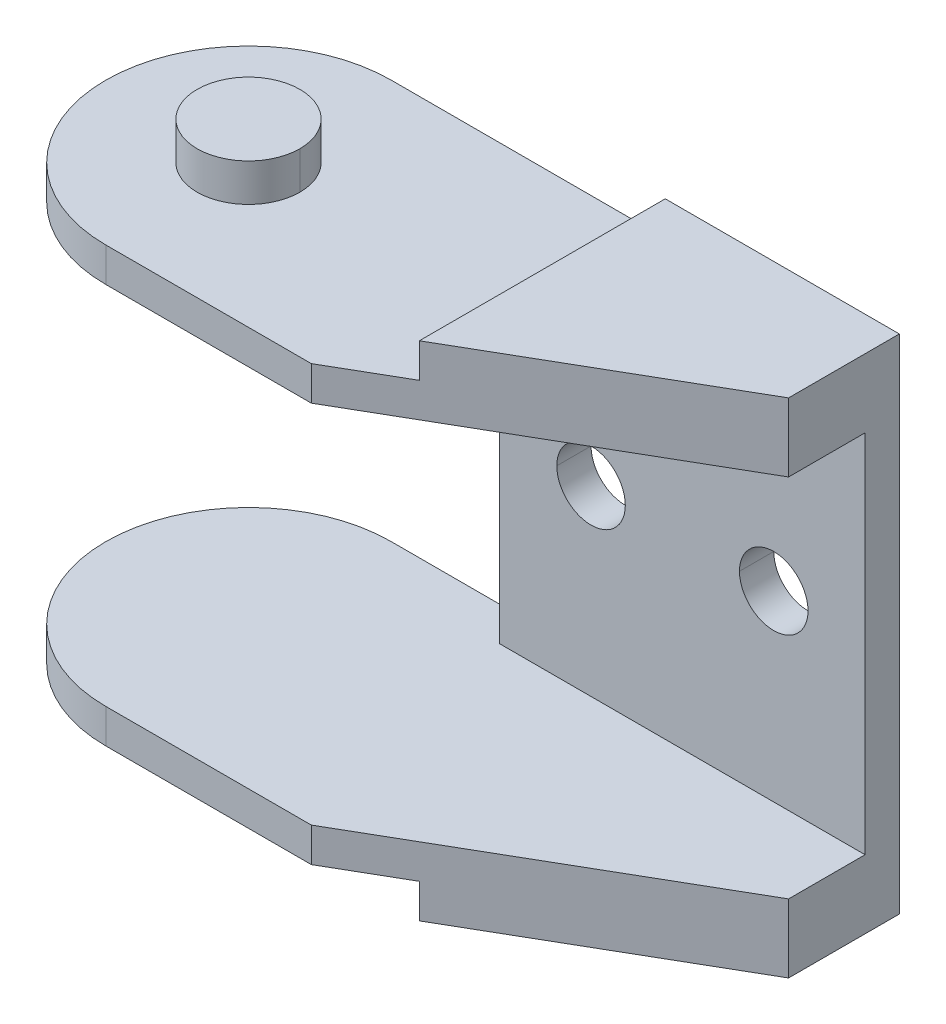
ISO-10303-21;
HEADER;
FILE_DESCRIPTION(('STEP AP214'),'2;1');
FILE_NAME('part.step','',(''),(''),'','','');
FILE_SCHEMA(('AUTOMOTIVE_DESIGN { 1 0 10303 214 1 1 1 1 }'));
ENDSEC;
DATA;
#1=APPLICATION_CONTEXT('core data for automotive mechanical design processes');
#2=APPLICATION_PROTOCOL_DEFINITION('international standard','automotive_design',2000,#1);
#3=PRODUCT_CONTEXT('',#1,'mechanical');
#4=PRODUCT('Part','Part','',(#3));
#5=PRODUCT_RELATED_PRODUCT_CATEGORY('part','',(#4));
#6=PRODUCT_DEFINITION_FORMATION('','',#4);
#7=PRODUCT_DEFINITION_CONTEXT('part definition',#1,'design');
#8=PRODUCT_DEFINITION('design','',#6,#7);
#9=PRODUCT_DEFINITION_SHAPE('','',#8);
#10=(LENGTH_UNIT() NAMED_UNIT(*) SI_UNIT(.MILLI.,.METRE.));
#11=(NAMED_UNIT(*) PLANE_ANGLE_UNIT() SI_UNIT($,.RADIAN.));
#12=(NAMED_UNIT(*) SI_UNIT($,.STERADIAN.) SOLID_ANGLE_UNIT());
#13=UNCERTAINTY_MEASURE_WITH_UNIT(LENGTH_MEASURE(1.E-05),#10,'distance_accuracy_value','');
#14=(GEOMETRIC_REPRESENTATION_CONTEXT(3) GLOBAL_UNCERTAINTY_ASSIGNED_CONTEXT((#13)) GLOBAL_UNIT_ASSIGNED_CONTEXT((#10,
#11,#12)) REPRESENTATION_CONTEXT('',''));
#15=CARTESIAN_POINT('',(0.,0.,0.));
#16=DIRECTION('',(0.,0.,1.));
#17=DIRECTION('',(1.,0.,0.));
#18=AXIS2_PLACEMENT_3D('',#15,#16,#17);
#19=CARTESIAN_POINT('',(0.,-10.325,0.));
#20=DIRECTION('',(0.,-1.,0.));
#21=DIRECTION('',(1.,0.,0.));
#22=AXIS2_PLACEMENT_3D('',#19,#20,#21);
#23=CYLINDRICAL_SURFACE('',#22,2.25);
#24=DIRECTION('',(0.,-1.,0.));
#25=VECTOR('',#24,1.);
#26=CARTESIAN_POINT('',(2.25,-10.325,0.));
#27=LINE('',#26,#25);
#28=CARTESIAN_POINT('',(2.25,-9.5,0.));
#29=VERTEX_POINT('',#28);
#30=CARTESIAN_POINT('',(2.25,-11.15,0.));
#31=VERTEX_POINT('',#30);
#32=EDGE_CURVE('E341',#29,#31,#27,.T.);
#33=ORIENTED_EDGE('',*,*,#32,.F.);
#34=CARTESIAN_POINT('',(0.,-9.5,0.));
#35=DIRECTION('',(0.,1.,0.));
#36=DIRECTION('',(1.,0.,0.));
#37=AXIS2_PLACEMENT_3D('',#34,#35,#36);
#38=CIRCLE('',#37,2.25);
#39=CARTESIAN_POINT('',(-2.25,-9.5,0.));
#40=VERTEX_POINT('',#39);
#41=EDGE_CURVE('E41',#40,#29,#38,.T.);
#42=ORIENTED_EDGE('',*,*,#41,.F.);
#43=DIRECTION('',(0.,1.,0.));
#44=VECTOR('',#43,1.);
#45=CARTESIAN_POINT('',(-2.25,-10.325,0.));
#46=LINE('',#45,#44);
#47=CARTESIAN_POINT('',(-2.25,-11.15,0.));
#48=VERTEX_POINT('',#47);
#49=EDGE_CURVE('E337',#48,#40,#46,.T.);
#50=ORIENTED_EDGE('',*,*,#49,.F.);
#51=CARTESIAN_POINT('',(0.,-11.15,0.));
#52=DIRECTION('',(0.,-1.,0.));
#53=DIRECTION('',(1.,0.,0.));
#54=AXIS2_PLACEMENT_3D('',#51,#52,#53);
#55=CIRCLE('',#54,2.25);
#56=EDGE_CURVE('E342',#31,#48,#55,.T.);
#57=ORIENTED_EDGE('',*,*,#56,.F.);
#58=EDGE_LOOP('',(#33,#42,#50,#57));
#59=FACE_BOUND('',#58,.T.);
#60=ADVANCED_FACE('F17',(#59),#23,.T.);
#61=CARTESIAN_POINT('',(0.,10.325,0.));
#62=DIRECTION('',(0.,-1.,0.));
#63=DIRECTION('',(1.,0.,0.));
#64=AXIS2_PLACEMENT_3D('',#61,#62,#63);
#65=CYLINDRICAL_SURFACE('',#64,2.25);
#66=DIRECTION('',(0.,-1.,0.));
#67=VECTOR('',#66,1.);
#68=CARTESIAN_POINT('',(2.25,10.325,0.));
#69=LINE('',#68,#67);
#70=CARTESIAN_POINT('',(2.25,11.15,0.));
#71=VERTEX_POINT('',#70);
#72=CARTESIAN_POINT('',(2.25,9.5,0.));
#73=VERTEX_POINT('',#72);
#74=EDGE_CURVE('E381',#71,#73,#69,.T.);
#75=ORIENTED_EDGE('',*,*,#74,.F.);
#76=CARTESIAN_POINT('',(0.,11.15,0.));
#77=DIRECTION('',(0.,1.,0.));
#78=DIRECTION('',(1.,0.,0.));
#79=AXIS2_PLACEMENT_3D('',#76,#77,#78);
#80=CIRCLE('',#79,2.25);
#81=CARTESIAN_POINT('',(-2.25,11.15,0.));
#82=VERTEX_POINT('',#81);
#83=EDGE_CURVE('E248',#82,#71,#80,.T.);
#84=ORIENTED_EDGE('',*,*,#83,.F.);
#85=DIRECTION('',(0.,1.,0.));
#86=VECTOR('',#85,1.);
#87=CARTESIAN_POINT('',(-2.25,10.325,0.));
#88=LINE('',#87,#86);
#89=CARTESIAN_POINT('',(-2.25,9.5,0.));
#90=VERTEX_POINT('',#89);
#91=EDGE_CURVE('E377',#90,#82,#88,.T.);
#92=ORIENTED_EDGE('',*,*,#91,.F.);
#93=CARTESIAN_POINT('',(0.,9.5,0.));
#94=DIRECTION('',(0.,-1.,0.));
#95=DIRECTION('',(1.,0.,0.));
#96=AXIS2_PLACEMENT_3D('',#93,#94,#95);
#97=CIRCLE('',#96,2.25);
#98=EDGE_CURVE('E249',#73,#90,#97,.T.);
#99=ORIENTED_EDGE('',*,*,#98,.F.);
#100=EDGE_LOOP('',(#75,#84,#92,#99));
#101=FACE_BOUND('',#100,.T.);
#102=ADVANCED_FACE('F460',(#101),#65,.T.);
#103=CARTESIAN_POINT('',(18.25,0.,-5.5));
#104=DIRECTION('',(0.,0.,1.));
#105=DIRECTION('',(1.,0.,0.));
#106=AXIS2_PLACEMENT_3D('',#103,#104,#105);
#107=CYLINDRICAL_SURFACE('',#106,1.5);
#108=DIRECTION('',(0.,0.,-1.));
#109=VECTOR('',#108,1.);
#110=CARTESIAN_POINT('',(19.75,0.,-5.5));
#111=LINE('',#110,#109);
#112=CARTESIAN_POINT('',(19.75,0.,-4.75));
#113=VERTEX_POINT('',#112);
#114=CARTESIAN_POINT('',(19.75,0.,-6.25));
#115=VERTEX_POINT('',#114);
#116=EDGE_CURVE('E269',#113,#115,#111,.T.);
#117=ORIENTED_EDGE('',*,*,#116,.F.);
#118=CARTESIAN_POINT('',(18.25,0.,-4.75));
#119=DIRECTION('',(0.,0.,-1.));
#120=DIRECTION('',(1.,0.,0.));
#121=AXIS2_PLACEMENT_3D('',#118,#119,#120);
#122=CIRCLE('',#121,1.5);
#123=CARTESIAN_POINT('',(16.75,0.,-4.75));
#124=VERTEX_POINT('',#123);
#125=EDGE_CURVE('E329',#124,#113,#122,.T.);
#126=ORIENTED_EDGE('',*,*,#125,.F.);
#127=DIRECTION('',(0.,0.,1.));
#128=VECTOR('',#127,1.);
#129=CARTESIAN_POINT('',(16.75,0.,-5.5));
#130=LINE('',#129,#128);
#131=CARTESIAN_POINT('',(16.75,0.,-6.25));
#132=VERTEX_POINT('',#131);
#133=EDGE_CURVE('E274',#132,#124,#130,.T.);
#134=ORIENTED_EDGE('',*,*,#133,.F.);
#135=CARTESIAN_POINT('',(18.25,0.,-6.25));
#136=DIRECTION('',(0.,0.,1.));
#137=DIRECTION('',(1.,0.,0.));
#138=AXIS2_PLACEMENT_3D('',#135,#136,#137);
#139=CIRCLE('',#138,1.5);
#140=EDGE_CURVE('E227',#115,#132,#139,.T.);
#141=ORIENTED_EDGE('',*,*,#140,.F.);
#142=EDGE_LOOP('',(#117,#126,#134,#141));
#143=FACE_BOUND('',#142,.T.);
#144=ADVANCED_FACE('F466',(#143),#107,.F.);
#145=CARTESIAN_POINT('',(10.25,0.,-5.5));
#146=DIRECTION('',(0.,0.,1.));
#147=DIRECTION('',(1.,0.,0.));
#148=AXIS2_PLACEMENT_3D('',#145,#146,#147);
#149=CYLINDRICAL_SURFACE('',#148,1.5);
#150=DIRECTION('',(0.,0.,-1.));
#151=VECTOR('',#150,1.);
#152=CARTESIAN_POINT('',(11.75,0.,-5.5));
#153=LINE('',#152,#151);
#154=CARTESIAN_POINT('',(11.75,0.,-4.75));
#155=VERTEX_POINT('',#154);
#156=CARTESIAN_POINT('',(11.75,0.,-6.25));
#157=VERTEX_POINT('',#156);
#158=EDGE_CURVE('E21',#155,#157,#153,.T.);
#159=ORIENTED_EDGE('',*,*,#158,.F.);
#160=CARTESIAN_POINT('',(10.25,0.,-4.75));
#161=DIRECTION('',(0.,0.,-1.));
#162=DIRECTION('',(1.,0.,0.));
#163=AXIS2_PLACEMENT_3D('',#160,#161,#162);
#164=CIRCLE('',#163,1.5);
#165=CARTESIAN_POINT('',(8.75,0.,-4.75));
#166=VERTEX_POINT('',#165);
#167=EDGE_CURVE('E343',#166,#155,#164,.T.);
#168=ORIENTED_EDGE('',*,*,#167,.F.);
#169=DIRECTION('',(0.,0.,1.));
#170=VECTOR('',#169,1.);
#171=CARTESIAN_POINT('',(8.75,0.,-5.5));
#172=LINE('',#171,#170);
#173=CARTESIAN_POINT('',(8.75,0.,-6.25));
#174=VERTEX_POINT('',#173);
#175=EDGE_CURVE('E273',#174,#166,#172,.T.);
#176=ORIENTED_EDGE('',*,*,#175,.F.);
#177=CARTESIAN_POINT('',(10.25,0.,-6.25));
#178=DIRECTION('',(0.,0.,1.));
#179=DIRECTION('',(1.,0.,0.));
#180=AXIS2_PLACEMENT_3D('',#177,#178,#179);
#181=CIRCLE('',#180,1.5);
#182=EDGE_CURVE('E358',#157,#174,#181,.T.);
#183=ORIENTED_EDGE('',*,*,#182,.F.);
#184=EDGE_LOOP('',(#159,#168,#176,#183));
#185=FACE_BOUND('',#184,.T.);
#186=ADVANCED_FACE('F431',(#185),#149,.F.);
#187=CARTESIAN_POINT('',(14.25,-9.5,-4.75));
#188=DIRECTION('',(0.,0.,1.));
#189=DIRECTION('',(1.,0.,0.));
#190=AXIS2_PLACEMENT_3D('',#187,#188,#189);
#191=PLANE('',#190);
#192=DIRECTION('',(-1.,0.,0.));
#193=VECTOR('',#192,1.);
#194=CARTESIAN_POINT('',(8.5625,-8.,-4.75));
#195=LINE('',#194,#193);
#196=CARTESIAN_POINT('',(22.25,-8.,-4.75));
#197=VERTEX_POINT('',#196);
#198=CARTESIAN_POINT('',(6.25,-8.,-4.75));
#199=VERTEX_POINT('',#198);
#200=EDGE_CURVE('E315',#197,#199,#195,.T.);
#201=ORIENTED_EDGE('',*,*,#200,.F.);
#202=DIRECTION('',(0.,1.,0.));
#203=VECTOR('',#202,1.);
#204=CARTESIAN_POINT('',(22.25,-9.5,-4.75));
#205=LINE('',#204,#203);
#206=CARTESIAN_POINT('',(22.25,8.,-4.75));
#207=VERTEX_POINT('',#206);
#208=EDGE_CURVE('E11',#197,#207,#205,.T.);
#209=ORIENTED_EDGE('',*,*,#208,.T.);
#210=DIRECTION('',(1.,0.,0.));
#211=VECTOR('',#210,1.);
#212=CARTESIAN_POINT('',(8.5625,8.,-4.75));
#213=LINE('',#212,#211);
#214=CARTESIAN_POINT('',(6.25,8.,-4.75));
#215=VERTEX_POINT('',#214);
#216=EDGE_CURVE('E352',#215,#207,#213,.T.);
#217=ORIENTED_EDGE('',*,*,#216,.F.);
#218=DIRECTION('',(0.,1.,0.));
#219=VECTOR('',#218,1.);
#220=CARTESIAN_POINT('',(6.25,-9.5,-4.75));
#221=LINE('',#220,#219);
#222=EDGE_CURVE('E386',#199,#215,#221,.T.);
#223=ORIENTED_EDGE('',*,*,#222,.F.);
#224=EDGE_LOOP('',(#201,#209,#217,#223));
#225=FACE_BOUND('',#224,.T.);
#226=CARTESIAN_POINT('',(18.25,0.,-4.75));
#227=DIRECTION('',(0.,0.,-1.));
#228=DIRECTION('',(1.,0.,0.));
#229=AXIS2_PLACEMENT_3D('',#226,#227,#228);
#230=CIRCLE('',#229,1.5);
#231=EDGE_CURVE('E28',#113,#124,#230,.T.);
#232=ORIENTED_EDGE('',*,*,#231,.T.);
#233=ORIENTED_EDGE('',*,*,#125,.T.);
#234=EDGE_LOOP('',(#232,#233));
#235=FACE_BOUND('',#234,.T.);
#236=CARTESIAN_POINT('',(10.25,0.,-4.75));
#237=DIRECTION('',(0.,0.,-1.));
#238=DIRECTION('',(1.,0.,0.));
#239=AXIS2_PLACEMENT_3D('',#236,#237,#238);
#240=CIRCLE('',#239,1.5);
#241=EDGE_CURVE('E347',#155,#166,#240,.T.);
#242=ORIENTED_EDGE('',*,*,#241,.T.);
#243=ORIENTED_EDGE('',*,*,#167,.T.);
#244=EDGE_LOOP('',(#242,#243));
#245=FACE_BOUND('',#244,.T.);
#246=ADVANCED_FACE('F438',(#225,#235,#245),#191,.T.);
#247=CARTESIAN_POINT('',(10.25,0.,-5.5));
#248=DIRECTION('',(0.,0.,1.));
#249=DIRECTION('',(1.,0.,0.));
#250=AXIS2_PLACEMENT_3D('',#247,#248,#249);
#251=CYLINDRICAL_SURFACE('',#250,1.5);
#252=ORIENTED_EDGE('',*,*,#158,.T.);
#253=CARTESIAN_POINT('',(10.25,0.,-6.25));
#254=DIRECTION('',(0.,0.,1.));
#255=DIRECTION('',(1.,0.,0.));
#256=AXIS2_PLACEMENT_3D('',#253,#254,#255);
#257=CIRCLE('',#256,1.5);
#258=EDGE_CURVE('E319',#174,#157,#257,.T.);
#259=ORIENTED_EDGE('',*,*,#258,.F.);
#260=ORIENTED_EDGE('',*,*,#175,.T.);
#261=ORIENTED_EDGE('',*,*,#241,.F.);
#262=EDGE_LOOP('',(#252,#259,#260,#261));
#263=FACE_BOUND('',#262,.T.);
#264=ADVANCED_FACE('F439',(#263),#251,.F.);
#265=CARTESIAN_POINT('',(18.25,0.,-5.5));
#266=DIRECTION('',(0.,0.,1.));
#267=DIRECTION('',(1.,0.,0.));
#268=AXIS2_PLACEMENT_3D('',#265,#266,#267);
#269=CYLINDRICAL_SURFACE('',#268,1.5);
#270=ORIENTED_EDGE('',*,*,#116,.T.);
#271=CARTESIAN_POINT('',(18.25,0.,-6.25));
#272=DIRECTION('',(0.,0.,1.));
#273=DIRECTION('',(1.,0.,0.));
#274=AXIS2_PLACEMENT_3D('',#271,#272,#273);
#275=CIRCLE('',#274,1.5);
#276=EDGE_CURVE('E362',#132,#115,#275,.T.);
#277=ORIENTED_EDGE('',*,*,#276,.F.);
#278=ORIENTED_EDGE('',*,*,#133,.T.);
#279=ORIENTED_EDGE('',*,*,#231,.F.);
#280=EDGE_LOOP('',(#270,#277,#278,#279));
#281=FACE_BOUND('',#280,.T.);
#282=ADVANCED_FACE('F406',(#281),#269,.F.);
#283=CARTESIAN_POINT('',(6.25,-9.5,-5.5));
#284=DIRECTION('',(-1.,0.,0.));
#285=DIRECTION('',(0.,0.,1.));
#286=AXIS2_PLACEMENT_3D('',#283,#284,#285);
#287=PLANE('',#286);
#288=DIRECTION('',(0.,0.,-1.));
#289=VECTOR('',#288,1.);
#290=CARTESIAN_POINT('',(6.25,-8.,-2.75));
#291=LINE('',#290,#289);
#292=CARTESIAN_POINT('',(6.25,-8.,-6.25));
#293=VERTEX_POINT('',#292);
#294=EDGE_CURVE('E320',#199,#293,#291,.T.);
#295=ORIENTED_EDGE('',*,*,#294,.F.);
#296=ORIENTED_EDGE('',*,*,#222,.T.);
#297=DIRECTION('',(0.,0.,1.));
#298=VECTOR('',#297,1.);
#299=CARTESIAN_POINT('',(6.25,8.,-2.75));
#300=LINE('',#299,#298);
#301=CARTESIAN_POINT('',(6.25,8.,-6.25));
#302=VERTEX_POINT('',#301);
#303=EDGE_CURVE('E348',#302,#215,#300,.T.);
#304=ORIENTED_EDGE('',*,*,#303,.F.);
#305=DIRECTION('',(0.,1.,0.));
#306=VECTOR('',#305,1.);
#307=CARTESIAN_POINT('',(6.25,-9.5,-6.25));
#308=LINE('',#307,#306);
#309=EDGE_CURVE('E321',#293,#302,#308,.T.);
#310=ORIENTED_EDGE('',*,*,#309,.F.);
#311=EDGE_LOOP('',(#295,#296,#304,#310));
#312=FACE_BOUND('',#311,.T.);
#313=ADVANCED_FACE('F475',(#312),#287,.T.);
#314=CARTESIAN_POINT('',(0.,10.325,0.));
#315=DIRECTION('',(0.,-1.,0.));
#316=DIRECTION('',(1.,0.,0.));
#317=AXIS2_PLACEMENT_3D('',#314,#315,#316);
#318=CYLINDRICAL_SURFACE('',#317,2.25);
#319=ORIENTED_EDGE('',*,*,#74,.T.);
#320=CARTESIAN_POINT('',(0.,9.5,0.));
#321=DIRECTION('',(0.,-1.,0.));
#322=DIRECTION('',(1.,0.,0.));
#323=AXIS2_PLACEMENT_3D('',#320,#321,#322);
#324=CIRCLE('',#323,2.25);
#325=EDGE_CURVE('E334',#90,#73,#324,.T.);
#326=ORIENTED_EDGE('',*,*,#325,.F.);
#327=ORIENTED_EDGE('',*,*,#91,.T.);
#328=CARTESIAN_POINT('',(0.,11.15,0.));
#329=DIRECTION('',(0.,1.,0.));
#330=DIRECTION('',(1.,0.,0.));
#331=AXIS2_PLACEMENT_3D('',#328,#329,#330);
#332=CIRCLE('',#331,2.25);
#333=EDGE_CURVE('E382',#71,#82,#332,.T.);
#334=ORIENTED_EDGE('',*,*,#333,.F.);
#335=EDGE_LOOP('',(#319,#326,#327,#334));
#336=FACE_BOUND('',#335,.T.);
#337=ADVANCED_FACE('F489',(#336),#318,.T.);
#338=CARTESIAN_POINT('',(0.,11.15,0.));
#339=DIRECTION('',(0.,1.,0.));
#340=DIRECTION('',(1.,0.,0.));
#341=AXIS2_PLACEMENT_3D('',#338,#339,#340);
#342=PLANE('',#341);
#343=ORIENTED_EDGE('',*,*,#333,.T.);
#344=ORIENTED_EDGE('',*,*,#83,.T.);
#345=EDGE_LOOP('',(#343,#344));
#346=FACE_BOUND('',#345,.T.);
#347=ADVANCED_FACE('F630',(#346),#342,.T.);
#348=CARTESIAN_POINT('',(-3.25,9.5,0.));
#349=DIRECTION('',(0.,1.,0.));
#350=DIRECTION('',(1.,0.,0.));
#351=AXIS2_PLACEMENT_3D('',#348,#349,#350);
#352=PLANE('',#351);
#353=DIRECTION('',(1.,0.,0.));
#354=VECTOR('',#353,1.);
#355=CARTESIAN_POINT('',(3.9375,9.5,-6.25));
#356=LINE('',#355,#354);
#357=CARTESIAN_POINT('',(0.,9.5,-6.25));
#358=VERTEX_POINT('',#357);
#359=CARTESIAN_POINT('',(12.,9.5,-6.25));
#360=VERTEX_POINT('',#359);
#361=EDGE_CURVE('E393',#358,#360,#356,.T.);
#362=ORIENTED_EDGE('',*,*,#361,.F.);
#363=CARTESIAN_POINT('',(0.,9.5,0.));
#364=DIRECTION('',(0.,-1.,0.));
#365=DIRECTION('',(0.,0.,1.));
#366=AXIS2_PLACEMENT_3D('',#363,#364,#365);
#367=CIRCLE('',#366,6.25);
#368=CARTESIAN_POINT('',(0.,9.5,6.25));
#369=VERTEX_POINT('',#368);
#370=EDGE_CURVE('E255',#369,#358,#367,.T.);
#371=ORIENTED_EDGE('',*,*,#370,.F.);
#372=DIRECTION('',(-1.,0.,0.));
#373=VECTOR('',#372,1.);
#374=CARTESIAN_POINT('',(0.625,9.5,6.25));
#375=LINE('',#374,#373);
#376=CARTESIAN_POINT('',(9.,9.5,6.25));
#377=VERTEX_POINT('',#376);
#378=EDGE_CURVE('E330',#377,#369,#375,.T.);
#379=ORIENTED_EDGE('',*,*,#378,.F.);
#380=DIRECTION('',(-0.866025403783379,0.,0.500000000001836));
#381=VECTOR('',#380,1.);
#382=CARTESIAN_POINT('',(9.07191469342775,9.5,6.2084800323906));
#383=LINE('',#382,#381);
#384=CARTESIAN_POINT('',(12.,9.5,4.51794919242264));
#385=VERTEX_POINT('',#384);
#386=EDGE_CURVE('E261',#385,#377,#383,.T.);
#387=ORIENTED_EDGE('',*,*,#386,.F.);
#388=DIRECTION('',(0.,0.,-1.));
#389=VECTOR('',#388,1.);
#390=CARTESIAN_POINT('',(12.,9.5,0.));
#391=LINE('',#390,#389);
#392=EDGE_CURVE('E245',#385,#360,#391,.T.);
#393=ORIENTED_EDGE('',*,*,#392,.T.);
#394=EDGE_LOOP('',(#362,#371,#379,#387,#393));
#395=FACE_BOUND('',#394,.T.);
#396=ORIENTED_EDGE('',*,*,#98,.T.);
#397=ORIENTED_EDGE('',*,*,#325,.T.);
#398=EDGE_LOOP('',(#396,#397));
#399=FACE_BOUND('',#398,.T.);
#400=ADVANCED_FACE('F643',(#395,#399),#352,.T.);
#401=CARTESIAN_POINT('',(12.,10.25,0.));
#402=DIRECTION('',(-1.,0.,0.));
#403=DIRECTION('',(0.,0.,1.));
#404=AXIS2_PLACEMENT_3D('',#401,#402,#403);
#405=PLANE('',#404);
#406=DIRECTION('',(0.,-1.,0.));
#407=VECTOR('',#406,1.);
#408=CARTESIAN_POINT('',(12.,-0.375,4.51794919242264));
#409=LINE('',#408,#407);
#410=CARTESIAN_POINT('',(12.,11.,4.51794919242264));
#411=VERTEX_POINT('',#410);
#412=EDGE_CURVE('E279',#411,#385,#409,.T.);
#413=ORIENTED_EDGE('',*,*,#412,.F.);
#414=DIRECTION('',(0.,0.,1.));
#415=VECTOR('',#414,1.);
#416=CARTESIAN_POINT('',(12.,11.,-0.452320951515931));
#417=LINE('',#416,#415);
#418=CARTESIAN_POINT('',(12.,11.,-6.25));
#419=VERTEX_POINT('',#418);
#420=EDGE_CURVE('E294',#419,#411,#417,.T.);
#421=ORIENTED_EDGE('',*,*,#420,.F.);
#422=DIRECTION('',(0.,1.,0.));
#423=VECTOR('',#422,1.);
#424=CARTESIAN_POINT('',(12.,-0.375,-6.25));
#425=LINE('',#424,#423);
#426=EDGE_CURVE('E224',#360,#419,#425,.T.);
#427=ORIENTED_EDGE('',*,*,#426,.F.);
#428=ORIENTED_EDGE('',*,*,#392,.F.);
#429=EDGE_LOOP('',(#413,#421,#427,#428));
#430=FACE_BOUND('',#429,.T.);
#431=ADVANCED_FACE('F19',(#430),#405,.T.);
#432=CARTESIAN_POINT('',(4.5,-11.,6.25));
#433=DIRECTION('',(0.,0.,1.));
#434=DIRECTION('',(1.,0.,0.));
#435=AXIS2_PLACEMENT_3D('',#432,#433,#434);
#436=PLANE('',#435);
#437=ORIENTED_EDGE('',*,*,#378,.T.);
#438=DIRECTION('',(0.,1.,0.));
#439=VECTOR('',#438,1.);
#440=CARTESIAN_POINT('',(0.,-11.,6.25));
#441=LINE('',#440,#439);
#442=CARTESIAN_POINT('',(0.,8.,6.25));
#443=VERTEX_POINT('',#442);
#444=EDGE_CURVE('E289',#443,#369,#441,.T.);
#445=ORIENTED_EDGE('',*,*,#444,.F.);
#446=DIRECTION('',(1.,0.,0.));
#447=VECTOR('',#446,1.);
#448=CARTESIAN_POINT('',(3.6875,8.,6.25));
#449=LINE('',#448,#447);
#450=CARTESIAN_POINT('',(9.,8.,6.25));
#451=VERTEX_POINT('',#450);
#452=EDGE_CURVE('E254',#443,#451,#449,.T.);
#453=ORIENTED_EDGE('',*,*,#452,.T.);
#454=DIRECTION('',(0.,1.,0.));
#455=VECTOR('',#454,1.);
#456=CARTESIAN_POINT('',(9.,-11.,6.25));
#457=LINE('',#456,#455);
#458=EDGE_CURVE('E251',#451,#377,#457,.T.);
#459=ORIENTED_EDGE('',*,*,#458,.T.);
#460=EDGE_LOOP('',(#437,#445,#453,#459));
#461=FACE_BOUND('',#460,.T.);
#462=ADVANCED_FACE('F486',(#461),#436,.T.);
#463=CARTESIAN_POINT('',(0.,-11.,0.));
#464=DIRECTION('',(0.,1.,0.));
#465=DIRECTION('',(0.,0.,1.));
#466=AXIS2_PLACEMENT_3D('',#463,#464,#465);
#467=CYLINDRICAL_SURFACE('',#466,6.25);
#468=ORIENTED_EDGE('',*,*,#370,.T.);
#469=DIRECTION('',(0.,1.,0.));
#470=VECTOR('',#469,1.);
#471=CARTESIAN_POINT('',(0.,-11.,-6.25));
#472=LINE('',#471,#470);
#473=CARTESIAN_POINT('',(0.,8.,-6.25));
#474=VERTEX_POINT('',#473);
#475=EDGE_CURVE('E368',#474,#358,#472,.T.);
#476=ORIENTED_EDGE('',*,*,#475,.F.);
#477=CARTESIAN_POINT('',(0.,8.,0.));
#478=DIRECTION('',(0.,1.,0.));
#479=DIRECTION('',(0.,0.,1.));
#480=AXIS2_PLACEMENT_3D('',#477,#478,#479);
#481=CIRCLE('',#480,6.25);
#482=EDGE_CURVE('E293',#474,#443,#481,.T.);
#483=ORIENTED_EDGE('',*,*,#482,.T.);
#484=ORIENTED_EDGE('',*,*,#444,.T.);
#485=EDGE_LOOP('',(#468,#476,#483,#484));
#486=FACE_BOUND('',#485,.T.);
#487=ADVANCED_FACE('F528',(#486),#467,.T.);
#488=CARTESIAN_POINT('',(7.94775638312467,11.,-0.904641903031862));
#489=DIRECTION('',(0.,-1.,0.));
#490=DIRECTION('',(0.,0.,-1.));
#491=AXIS2_PLACEMENT_3D('',#488,#489,#490);
#492=PLANE('',#491);
#493=ORIENTED_EDGE('',*,*,#420,.T.);
#494=DIRECTION('',(-0.866025403783379,0.,0.500000000001836));
#495=VECTOR('',#494,1.);
#496=CARTESIAN_POINT('',(22.25,11.,-1.3998910668));
#497=LINE('',#496,#495);
#498=CARTESIAN_POINT('',(22.25,11.,-1.3998910668));
#499=VERTEX_POINT('',#498);
#500=EDGE_CURVE('E209',#499,#411,#497,.T.);
#501=ORIENTED_EDGE('',*,*,#500,.F.);
#502=DIRECTION('',(0.,0.,1.));
#503=VECTOR('',#502,1.);
#504=CARTESIAN_POINT('',(22.25,11.,-6.25));
#505=LINE('',#504,#503);
#506=CARTESIAN_POINT('',(22.25,11.,-6.25));
#507=VERTEX_POINT('',#506);
#508=EDGE_CURVE('E203',#507,#499,#505,.T.);
#509=ORIENTED_EDGE('',*,*,#508,.F.);
#510=DIRECTION('',(1.,0.,0.));
#511=VECTOR('',#510,1.);
#512=CARTESIAN_POINT('',(0.,11.,-6.25));
#513=LINE('',#512,#511);
#514=EDGE_CURVE('E207',#419,#507,#513,.T.);
#515=ORIENTED_EDGE('',*,*,#514,.F.);
#516=EDGE_LOOP('',(#493,#501,#509,#515));
#517=FACE_BOUND('',#516,.T.);
#518=ADVANCED_FACE('F206',(#517),#492,.F.);
#519=CARTESIAN_POINT('',(2.875,8.,0.));
#520=DIRECTION('',(0.,-1.,0.));
#521=DIRECTION('',(0.,0.,-1.));
#522=AXIS2_PLACEMENT_3D('',#519,#520,#521);
#523=PLANE('',#522);
#524=ORIENTED_EDGE('',*,*,#216,.T.);
#525=DIRECTION('',(0.,0.,-1.));
#526=VECTOR('',#525,1.);
#527=CARTESIAN_POINT('',(22.25,8.,-1.9124727667));
#528=LINE('',#527,#526);
#529=CARTESIAN_POINT('',(22.25,8.,-1.3998910668));
#530=VERTEX_POINT('',#529);
#531=EDGE_CURVE('E216',#530,#207,#528,.T.);
#532=ORIENTED_EDGE('',*,*,#531,.F.);
#533=DIRECTION('',(0.866025403783379,0.,-0.500000000001836));
#534=VECTOR('',#533,1.);
#535=CARTESIAN_POINT('',(11.3687896934221,8.,4.88237863284243));
#536=LINE('',#535,#534);
#537=EDGE_CURVE('E257',#451,#530,#536,.T.);
#538=ORIENTED_EDGE('',*,*,#537,.F.);
#539=ORIENTED_EDGE('',*,*,#452,.F.);
#540=ORIENTED_EDGE('',*,*,#482,.F.);
#541=DIRECTION('',(-1.,0.,0.));
#542=VECTOR('',#541,1.);
#543=CARTESIAN_POINT('',(7.,8.,-6.25));
#544=LINE('',#543,#542);
#545=EDGE_CURVE('E325',#302,#474,#544,.T.);
#546=ORIENTED_EDGE('',*,*,#545,.F.);
#547=ORIENTED_EDGE('',*,*,#303,.T.);
#548=EDGE_LOOP('',(#524,#532,#538,#539,#540,#546,#547));
#549=FACE_BOUND('',#548,.T.);
#550=ADVANCED_FACE('F454',(#549),#523,.T.);
#551=CARTESIAN_POINT('',(15.625,-11.,2.4250544666));
#552=DIRECTION('',(0.500000000001836,0.,0.866025403783379));
#553=DIRECTION('',(0.,-1.,0.));
#554=AXIS2_PLACEMENT_3D('',#551,#552,#553);
#555=PLANE('',#554);
#556=ORIENTED_EDGE('',*,*,#386,.T.);
#557=ORIENTED_EDGE('',*,*,#458,.F.);
#558=ORIENTED_EDGE('',*,*,#537,.T.);
#559=DIRECTION('',(0.,1.,0.));
#560=VECTOR('',#559,1.);
#561=CARTESIAN_POINT('',(22.25,-11.,-1.3998910668));
#562=LINE('',#561,#560);
#563=EDGE_CURVE('E262',#530,#499,#562,.T.);
#564=ORIENTED_EDGE('',*,*,#563,.T.);
#565=ORIENTED_EDGE('',*,*,#500,.T.);
#566=ORIENTED_EDGE('',*,*,#412,.T.);
#567=EDGE_LOOP('',(#556,#557,#558,#564,#565,#566));
#568=FACE_BOUND('',#567,.T.);
#569=ADVANCED_FACE('F444',(#568),#555,.T.);
#570=CARTESIAN_POINT('',(11.125,-11.,-6.25));
#571=DIRECTION('',(0.,0.,-1.));
#572=DIRECTION('',(0.,-1.,0.));
#573=AXIS2_PLACEMENT_3D('',#570,#571,#572);
#574=PLANE('',#573);
#575=DIRECTION('',(0.,1.,0.));
#576=VECTOR('',#575,1.);
#577=CARTESIAN_POINT('',(12.,-10.625,-6.25));
#578=LINE('',#577,#576);
#579=CARTESIAN_POINT('',(12.,-11.,-6.25));
#580=VERTEX_POINT('',#579);
#581=CARTESIAN_POINT('',(12.,-9.5,-6.25));
#582=VERTEX_POINT('',#581);
#583=EDGE_CURVE('E283',#580,#582,#578,.T.);
#584=ORIENTED_EDGE('',*,*,#583,.T.);
#585=DIRECTION('',(-1.,0.,0.));
#586=VECTOR('',#585,1.);
#587=CARTESIAN_POINT('',(3.9375,-9.5,-6.25));
#588=LINE('',#587,#586);
#589=CARTESIAN_POINT('',(0.,-9.5,-6.25));
#590=VERTEX_POINT('',#589);
#591=EDGE_CURVE('E284',#582,#590,#588,.T.);
#592=ORIENTED_EDGE('',*,*,#591,.T.);
#593=DIRECTION('',(0.,1.,0.));
#594=VECTOR('',#593,1.);
#595=CARTESIAN_POINT('',(0.,-11.,-6.25));
#596=LINE('',#595,#594);
#597=CARTESIAN_POINT('',(0.,-8.,-6.25));
#598=VERTEX_POINT('',#597);
#599=EDGE_CURVE('E288',#590,#598,#596,.T.);
#600=ORIENTED_EDGE('',*,*,#599,.T.);
#601=DIRECTION('',(1.,0.,0.));
#602=VECTOR('',#601,1.);
#603=CARTESIAN_POINT('',(7.,-8.,-6.25));
#604=LINE('',#603,#602);
#605=EDGE_CURVE('E324',#598,#293,#604,.T.);
#606=ORIENTED_EDGE('',*,*,#605,.T.);
#607=ORIENTED_EDGE('',*,*,#309,.T.);
#608=ORIENTED_EDGE('',*,*,#545,.T.);
#609=ORIENTED_EDGE('',*,*,#475,.T.);
#610=ORIENTED_EDGE('',*,*,#361,.T.);
#611=ORIENTED_EDGE('',*,*,#426,.T.);
#612=ORIENTED_EDGE('',*,*,#514,.T.);
#613=DIRECTION('',(0.,1.,0.));
#614=VECTOR('',#613,1.);
#615=CARTESIAN_POINT('',(22.25,-11.,-6.25));
#616=LINE('',#615,#614);
#617=CARTESIAN_POINT('',(22.25,-11.,-6.25));
#618=VERTEX_POINT('',#617);
#619=EDGE_CURVE('E215',#618,#507,#616,.T.);
#620=ORIENTED_EDGE('',*,*,#619,.F.);
#621=DIRECTION('',(1.,0.,0.));
#622=VECTOR('',#621,1.);
#623=CARTESIAN_POINT('',(0.,-11.,-6.25));
#624=LINE('',#623,#622);
#625=EDGE_CURVE('E308',#580,#618,#624,.T.);
#626=ORIENTED_EDGE('',*,*,#625,.F.);
#627=EDGE_LOOP('',(#584,#592,#600,#606,#607,#608,#609,#610,#611,#612,#620,#626));
#628=FACE_BOUND('',#627,.T.);
#629=ORIENTED_EDGE('',*,*,#140,.T.);
#630=ORIENTED_EDGE('',*,*,#276,.T.);
#631=EDGE_LOOP('',(#629,#630));
#632=FACE_BOUND('',#631,.T.);
#633=ORIENTED_EDGE('',*,*,#182,.T.);
#634=ORIENTED_EDGE('',*,*,#258,.T.);
#635=EDGE_LOOP('',(#633,#634));
#636=FACE_BOUND('',#635,.T.);
#637=ADVANCED_FACE('F220',(#628,#632,#636),#574,.T.);
#638=CARTESIAN_POINT('',(2.875,-8.,0.));
#639=DIRECTION('',(0.,-1.,0.));
#640=DIRECTION('',(0.,0.,-1.));
#641=AXIS2_PLACEMENT_3D('',#638,#639,#640);
#642=PLANE('',#641);
#643=ORIENTED_EDGE('',*,*,#200,.T.);
#644=ORIENTED_EDGE('',*,*,#294,.T.);
#645=ORIENTED_EDGE('',*,*,#605,.F.);
#646=CARTESIAN_POINT('',(0.,-8.,0.));
#647=DIRECTION('',(0.,-1.,0.));
#648=DIRECTION('',(0.,0.,1.));
#649=AXIS2_PLACEMENT_3D('',#646,#647,#648);
#650=CIRCLE('',#649,6.25);
#651=CARTESIAN_POINT('',(0.,-8.,6.25));
#652=VERTEX_POINT('',#651);
#653=EDGE_CURVE('E268',#652,#598,#650,.T.);
#654=ORIENTED_EDGE('',*,*,#653,.F.);
#655=DIRECTION('',(-1.,0.,0.));
#656=VECTOR('',#655,1.);
#657=CARTESIAN_POINT('',(3.6875,-8.,6.25));
#658=LINE('',#657,#656);
#659=CARTESIAN_POINT('',(9.,-8.,6.25));
#660=VERTEX_POINT('',#659);
#661=EDGE_CURVE('E278',#660,#652,#658,.T.);
#662=ORIENTED_EDGE('',*,*,#661,.F.);
#663=DIRECTION('',(-0.866025403783379,0.,0.500000000001836));
#664=VECTOR('',#663,1.);
#665=CARTESIAN_POINT('',(11.3687896934221,-8.,4.88237863284243));
#666=LINE('',#665,#664);
#667=CARTESIAN_POINT('',(22.25,-8.,-1.3998910668));
#668=VERTEX_POINT('',#667);
#669=EDGE_CURVE('E553',#668,#660,#666,.T.);
#670=ORIENTED_EDGE('',*,*,#669,.F.);
#671=DIRECTION('',(0.,0.,1.));
#672=VECTOR('',#671,1.);
#673=CARTESIAN_POINT('',(22.25,-8.,-1.9124727667));
#674=LINE('',#673,#672);
#675=EDGE_CURVE('E541',#197,#668,#674,.T.);
#676=ORIENTED_EDGE('',*,*,#675,.F.);
#677=EDGE_LOOP('',(#643,#644,#645,#654,#662,#670,#676));
#678=FACE_BOUND('',#677,.T.);
#679=ADVANCED_FACE('F443',(#678),#642,.F.);
#680=CARTESIAN_POINT('',(0.,-10.325,0.));
#681=DIRECTION('',(0.,-1.,0.));
#682=DIRECTION('',(1.,0.,0.));
#683=AXIS2_PLACEMENT_3D('',#680,#681,#682);
#684=CYLINDRICAL_SURFACE('',#683,2.25);
#685=ORIENTED_EDGE('',*,*,#32,.T.);
#686=CARTESIAN_POINT('',(0.,-11.15,0.));
#687=DIRECTION('',(0.,-1.,0.));
#688=DIRECTION('',(1.,0.,0.));
#689=AXIS2_PLACEMENT_3D('',#686,#687,#688);
#690=CIRCLE('',#689,2.25);
#691=EDGE_CURVE('E305',#48,#31,#690,.T.);
#692=ORIENTED_EDGE('',*,*,#691,.F.);
#693=ORIENTED_EDGE('',*,*,#49,.T.);
#694=CARTESIAN_POINT('',(0.,-9.5,0.));
#695=DIRECTION('',(0.,1.,0.));
#696=DIRECTION('',(1.,0.,0.));
#697=AXIS2_PLACEMENT_3D('',#694,#695,#696);
#698=CIRCLE('',#697,2.25);
#699=EDGE_CURVE('E298',#29,#40,#698,.T.);
#700=ORIENTED_EDGE('',*,*,#699,.F.);
#701=EDGE_LOOP('',(#685,#692,#693,#700));
#702=FACE_BOUND('',#701,.T.);
#703=ADVANCED_FACE('F451',(#702),#684,.T.);
#704=CARTESIAN_POINT('',(0.,-11.15,0.));
#705=DIRECTION('',(0.,-1.,0.));
#706=DIRECTION('',(0.,0.,-1.));
#707=AXIS2_PLACEMENT_3D('',#704,#705,#706);
#708=PLANE('',#707);
#709=ORIENTED_EDGE('',*,*,#56,.T.);
#710=ORIENTED_EDGE('',*,*,#691,.T.);
#711=EDGE_LOOP('',(#709,#710));
#712=FACE_BOUND('',#711,.T.);
#713=ADVANCED_FACE('F516',(#712),#708,.T.);
#714=CARTESIAN_POINT('',(12.,-10.25,0.));
#715=DIRECTION('',(-1.,0.,0.));
#716=DIRECTION('',(0.,0.,1.));
#717=AXIS2_PLACEMENT_3D('',#714,#715,#716);
#718=PLANE('',#717);
#719=DIRECTION('',(0.,-1.,0.));
#720=VECTOR('',#719,1.);
#721=CARTESIAN_POINT('',(12.,-10.625,4.51794919242264));
#722=LINE('',#721,#720);
#723=CARTESIAN_POINT('',(12.,-9.5,4.51794919242264));
#724=VERTEX_POINT('',#723);
#725=CARTESIAN_POINT('',(12.,-11.,4.51794919242264));
#726=VERTEX_POINT('',#725);
#727=EDGE_CURVE('E309',#724,#726,#722,.T.);
#728=ORIENTED_EDGE('',*,*,#727,.F.);
#729=DIRECTION('',(0.,0.,-1.));
#730=VECTOR('',#729,1.);
#731=CARTESIAN_POINT('',(12.,-9.5,0.));
#732=LINE('',#731,#730);
#733=EDGE_CURVE('E301',#724,#582,#732,.T.);
#734=ORIENTED_EDGE('',*,*,#733,.T.);
#735=ORIENTED_EDGE('',*,*,#583,.F.);
#736=DIRECTION('',(0.,0.,-1.));
#737=VECTOR('',#736,1.);
#738=CARTESIAN_POINT('',(12.,-11.,-0.452320951515931));
#739=LINE('',#738,#737);
#740=EDGE_CURVE('E374',#726,#580,#739,.T.);
#741=ORIENTED_EDGE('',*,*,#740,.F.);
#742=EDGE_LOOP('',(#728,#734,#735,#741));
#743=FACE_BOUND('',#742,.T.);
#744=ADVANCED_FACE('F513',(#743),#718,.T.);
#745=CARTESIAN_POINT('',(-3.25,-9.5,0.));
#746=DIRECTION('',(0.,-1.,0.));
#747=DIRECTION('',(0.,0.,-1.));
#748=AXIS2_PLACEMENT_3D('',#745,#746,#747);
#749=PLANE('',#748);
#750=ORIENTED_EDGE('',*,*,#733,.F.);
#751=DIRECTION('',(0.866025403783379,0.,-0.500000000001836));
#752=VECTOR('',#751,1.);
#753=CARTESIAN_POINT('',(9.07191469342775,-9.5,6.2084800323906));
#754=LINE('',#753,#752);
#755=CARTESIAN_POINT('',(9.,-9.5,6.25));
#756=VERTEX_POINT('',#755);
#757=EDGE_CURVE('E313',#756,#724,#754,.T.);
#758=ORIENTED_EDGE('',*,*,#757,.F.);
#759=DIRECTION('',(1.,0.,0.));
#760=VECTOR('',#759,1.);
#761=CARTESIAN_POINT('',(0.625,-9.5,6.25));
#762=LINE('',#761,#760);
#763=CARTESIAN_POINT('',(0.,-9.5,6.25));
#764=VERTEX_POINT('',#763);
#765=EDGE_CURVE('E546',#764,#756,#762,.T.);
#766=ORIENTED_EDGE('',*,*,#765,.F.);
#767=CARTESIAN_POINT('',(0.,-9.5,0.));
#768=DIRECTION('',(0.,1.,0.));
#769=DIRECTION('',(0.,0.,1.));
#770=AXIS2_PLACEMENT_3D('',#767,#768,#769);
#771=CIRCLE('',#770,6.25);
#772=EDGE_CURVE('E267',#590,#764,#771,.T.);
#773=ORIENTED_EDGE('',*,*,#772,.F.);
#774=ORIENTED_EDGE('',*,*,#591,.F.);
#775=EDGE_LOOP('',(#750,#758,#766,#773,#774));
#776=FACE_BOUND('',#775,.T.);
#777=ORIENTED_EDGE('',*,*,#699,.T.);
#778=ORIENTED_EDGE('',*,*,#41,.T.);
#779=EDGE_LOOP('',(#777,#778));
#780=FACE_BOUND('',#779,.T.);
#781=ADVANCED_FACE('F507',(#776,#780),#749,.T.);
#782=CARTESIAN_POINT('',(15.625,-11.,2.4250544666));
#783=DIRECTION('',(0.500000000001836,0.,0.866025403783379));
#784=DIRECTION('',(0.,-1.,0.));
#785=AXIS2_PLACEMENT_3D('',#782,#783,#784);
#786=PLANE('',#785);
#787=ORIENTED_EDGE('',*,*,#757,.T.);
#788=ORIENTED_EDGE('',*,*,#727,.T.);
#789=DIRECTION('',(-0.866025403783379,0.,0.500000000001836));
#790=VECTOR('',#789,1.);
#791=CARTESIAN_POINT('',(22.25,-11.,-1.3998910668));
#792=LINE('',#791,#790);
#793=CARTESIAN_POINT('',(22.25,-11.,-1.3998910668));
#794=VERTEX_POINT('',#793);
#795=EDGE_CURVE('E235',#794,#726,#792,.T.);
#796=ORIENTED_EDGE('',*,*,#795,.F.);
#797=DIRECTION('',(0.,1.,0.));
#798=VECTOR('',#797,1.);
#799=CARTESIAN_POINT('',(22.25,-11.,-1.3998910668));
#800=LINE('',#799,#798);
#801=EDGE_CURVE('E314',#794,#668,#800,.T.);
#802=ORIENTED_EDGE('',*,*,#801,.T.);
#803=ORIENTED_EDGE('',*,*,#669,.T.);
#804=DIRECTION('',(0.,1.,0.));
#805=VECTOR('',#804,1.);
#806=CARTESIAN_POINT('',(9.,-11.,6.25));
#807=LINE('',#806,#805);
#808=EDGE_CURVE('E595',#756,#660,#807,.T.);
#809=ORIENTED_EDGE('',*,*,#808,.F.);
#810=EDGE_LOOP('',(#787,#788,#796,#802,#803,#809));
#811=FACE_BOUND('',#810,.T.);
#812=ADVANCED_FACE('F501',(#811),#786,.T.);
#813=CARTESIAN_POINT('',(7.94775638312467,-11.,-0.904641903031862));
#814=DIRECTION('',(0.,-1.,0.));
#815=DIRECTION('',(0.,0.,-1.));
#816=AXIS2_PLACEMENT_3D('',#813,#814,#815);
#817=PLANE('',#816);
#818=ORIENTED_EDGE('',*,*,#740,.T.);
#819=ORIENTED_EDGE('',*,*,#625,.T.);
#820=DIRECTION('',(0.,0.,1.));
#821=VECTOR('',#820,1.);
#822=CARTESIAN_POINT('',(22.25,-11.,-6.25));
#823=LINE('',#822,#821);
#824=EDGE_CURVE('E233',#618,#794,#823,.T.);
#825=ORIENTED_EDGE('',*,*,#824,.T.);
#826=ORIENTED_EDGE('',*,*,#795,.T.);
#827=EDGE_LOOP('',(#818,#819,#825,#826));
#828=FACE_BOUND('',#827,.T.);
#829=ADVANCED_FACE('F493',(#828),#817,.T.);
#830=CARTESIAN_POINT('',(22.25,-11.,-3.8249455334));
#831=DIRECTION('',(1.,0.,0.));
#832=DIRECTION('',(0.,1.,0.));
#833=AXIS2_PLACEMENT_3D('',#830,#831,#832);
#834=PLANE('',#833);
#835=ORIENTED_EDGE('',*,*,#619,.T.);
#836=ORIENTED_EDGE('',*,*,#508,.T.);
#837=ORIENTED_EDGE('',*,*,#563,.F.);
#838=ORIENTED_EDGE('',*,*,#531,.T.);
#839=ORIENTED_EDGE('',*,*,#208,.F.);
#840=ORIENTED_EDGE('',*,*,#675,.T.);
#841=ORIENTED_EDGE('',*,*,#801,.F.);
#842=ORIENTED_EDGE('',*,*,#824,.F.);
#843=EDGE_LOOP('',(#835,#836,#837,#838,#839,#840,#841,#842));
#844=FACE_BOUND('',#843,.T.);
#845=ADVANCED_FACE('F230',(#844),#834,.T.);
#846=CARTESIAN_POINT('',(4.5,-11.,6.25));
#847=DIRECTION('',(0.,0.,1.));
#848=DIRECTION('',(1.,0.,0.));
#849=AXIS2_PLACEMENT_3D('',#846,#847,#848);
#850=PLANE('',#849);
#851=ORIENTED_EDGE('',*,*,#765,.T.);
#852=ORIENTED_EDGE('',*,*,#808,.T.);
#853=ORIENTED_EDGE('',*,*,#661,.T.);
#854=DIRECTION('',(0.,1.,0.));
#855=VECTOR('',#854,1.);
#856=CARTESIAN_POINT('',(0.,-11.,6.25));
#857=LINE('',#856,#855);
#858=EDGE_CURVE('E263',#764,#652,#857,.T.);
#859=ORIENTED_EDGE('',*,*,#858,.F.);
#860=EDGE_LOOP('',(#851,#852,#853,#859));
#861=FACE_BOUND('',#860,.T.);
#862=ADVANCED_FACE('F492',(#861),#850,.T.);
#863=CARTESIAN_POINT('',(0.,-11.,0.));
#864=DIRECTION('',(0.,1.,0.));
#865=DIRECTION('',(0.,0.,1.));
#866=AXIS2_PLACEMENT_3D('',#863,#864,#865);
#867=CYLINDRICAL_SURFACE('',#866,6.25);
#868=ORIENTED_EDGE('',*,*,#772,.T.);
#869=ORIENTED_EDGE('',*,*,#858,.T.);
#870=ORIENTED_EDGE('',*,*,#653,.T.);
#871=ORIENTED_EDGE('',*,*,#599,.F.);
#872=EDGE_LOOP('',(#868,#869,#870,#871));
#873=FACE_BOUND('',#872,.T.);
#874=ADVANCED_FACE('F498',(#873),#867,.T.);
#875=CLOSED_SHELL('',(#60,#102,#144,#186,#246,#264,#282,#313,#337,#347,#400,#431,#462,#487,#518,
#550,#569,#637,#679,#703,#713,#744,#781,#812,#829,#845,#862,#874));
#876=MANIFOLD_SOLID_BREP('B1',#875);
#877=ADVANCED_BREP_SHAPE_REPRESENTATION('',(#18,#876),#14);
#878=SHAPE_DEFINITION_REPRESENTATION(#9,#877);
ENDSEC;
END-ISO-10303-21;
